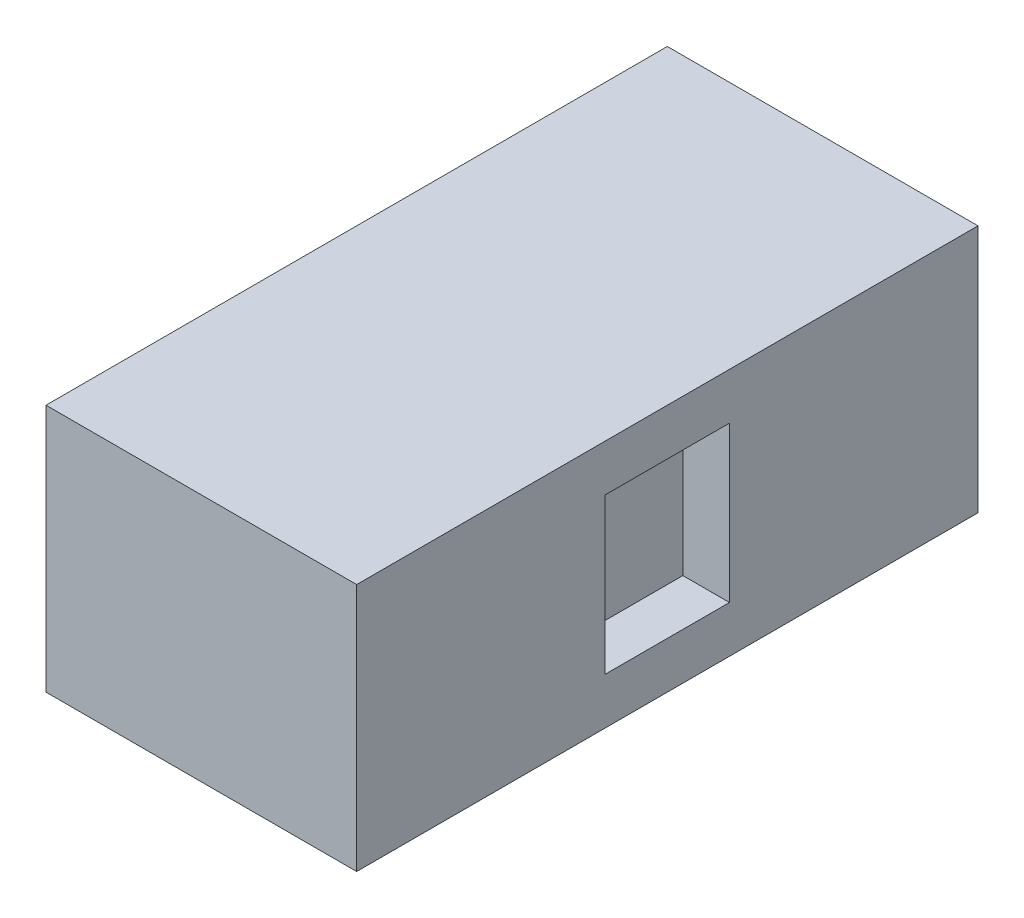
ISO-10303-21;
HEADER;
FILE_DESCRIPTION(('STEP AP214'),'2;1');
FILE_NAME('part.step','',(''),(''),'','','');
FILE_SCHEMA(('AUTOMOTIVE_DESIGN { 1 0 10303 214 1 1 1 1 }'));
ENDSEC;
DATA;
#1=APPLICATION_CONTEXT('core data for automotive mechanical design processes');
#2=APPLICATION_PROTOCOL_DEFINITION('international standard','automotive_design',2000,#1);
#3=PRODUCT_CONTEXT('',#1,'mechanical');
#4=PRODUCT('Part','Part','',(#3));
#5=PRODUCT_RELATED_PRODUCT_CATEGORY('part','',(#4));
#6=PRODUCT_DEFINITION_FORMATION('','',#4);
#7=PRODUCT_DEFINITION_CONTEXT('part definition',#1,'design');
#8=PRODUCT_DEFINITION('design','',#6,#7);
#9=PRODUCT_DEFINITION_SHAPE('','',#8);
#10=(LENGTH_UNIT() NAMED_UNIT(*) SI_UNIT(.MILLI.,.METRE.));
#11=(NAMED_UNIT(*) PLANE_ANGLE_UNIT() SI_UNIT($,.RADIAN.));
#12=(NAMED_UNIT(*) SI_UNIT($,.STERADIAN.) SOLID_ANGLE_UNIT());
#13=UNCERTAINTY_MEASURE_WITH_UNIT(LENGTH_MEASURE(1.E-05),#10,'distance_accuracy_value','');
#14=(GEOMETRIC_REPRESENTATION_CONTEXT(3) GLOBAL_UNCERTAINTY_ASSIGNED_CONTEXT((#13)) GLOBAL_UNIT_ASSIGNED_CONTEXT((#10,
#11,#12)) REPRESENTATION_CONTEXT('',''));
#15=CARTESIAN_POINT('',(0.,0.,0.));
#16=DIRECTION('',(0.,0.,1.));
#17=DIRECTION('',(1.,0.,0.));
#18=AXIS2_PLACEMENT_3D('',#15,#16,#17);
#19=CARTESIAN_POINT('',(0.,3.,0.));
#20=DIRECTION('',(0.,1.,0.));
#21=DIRECTION('',(0.,0.,1.));
#22=AXIS2_PLACEMENT_3D('',#19,#20,#21);
#23=PLANE('',#22);
#24=DIRECTION('',(0.,0.,-1.));
#25=VECTOR('',#24,1.);
#26=CARTESIAN_POINT('',(10.,3.,20.));
#27=LINE('',#26,#25);
#28=CARTESIAN_POINT('',(10.,3.,4.));
#29=VERTEX_POINT('',#28);
#30=CARTESIAN_POINT('',(10.,3.,-4.));
#31=VERTEX_POINT('',#30);
#32=EDGE_CURVE('E62',#29,#31,#27,.T.);
#33=ORIENTED_EDGE('',*,*,#32,.T.);
#34=DIRECTION('',(-1.,0.,0.));
#35=VECTOR('',#34,1.);
#36=CARTESIAN_POINT('',(0.,3.,-4.));
#37=LINE('',#36,#35);
#38=CARTESIAN_POINT('',(7.,3.,-4.));
#39=VERTEX_POINT('',#38);
#40=EDGE_CURVE('E57',#31,#39,#37,.T.);
#41=ORIENTED_EDGE('',*,*,#40,.T.);
#42=DIRECTION('',(0.,0.,-1.));
#43=VECTOR('',#42,1.);
#44=CARTESIAN_POINT('',(7.,3.,0.));
#45=LINE('',#44,#43);
#46=CARTESIAN_POINT('',(7.,3.,4.));
#47=VERTEX_POINT('',#46);
#48=EDGE_CURVE('E142',#47,#39,#45,.T.);
#49=ORIENTED_EDGE('',*,*,#48,.F.);
#50=DIRECTION('',(-1.,0.,0.));
#51=VECTOR('',#50,1.);
#52=CARTESIAN_POINT('',(0.,3.,4.));
#53=LINE('',#52,#51);
#54=EDGE_CURVE('E153',#29,#47,#53,.T.);
#55=ORIENTED_EDGE('',*,*,#54,.F.);
#56=EDGE_LOOP('',(#33,#41,#49,#55));
#57=FACE_BOUND('',#56,.T.);
#58=ADVANCED_FACE('F41',(#57),#23,.T.);
#59=CARTESIAN_POINT('',(-10.,3.,20.));
#60=DIRECTION('',(1.,0.,0.));
#61=DIRECTION('',(0.,0.,-1.));
#62=AXIS2_PLACEMENT_3D('',#59,#60,#61);
#63=PLANE('',#62);
#64=DIRECTION('',(0.,0.,1.));
#65=VECTOR('',#64,1.);
#66=CARTESIAN_POINT('',(-10.,0.,20.));
#67=LINE('',#66,#65);
#68=CARTESIAN_POINT('',(-10.,0.,-20.));
#69=VERTEX_POINT('',#68);
#70=CARTESIAN_POINT('',(-10.,0.,20.));
#71=VERTEX_POINT('',#70);
#72=EDGE_CURVE('E111',#69,#71,#67,.T.);
#73=ORIENTED_EDGE('',*,*,#72,.T.);
#74=DIRECTION('',(0.,-1.,0.));
#75=VECTOR('',#74,1.);
#76=CARTESIAN_POINT('',(-10.,3.,20.));
#77=LINE('',#76,#75);
#78=CARTESIAN_POINT('',(-10.,16.,20.));
#79=VERTEX_POINT('',#78);
#80=EDGE_CURVE('E11',#79,#71,#77,.T.);
#81=ORIENTED_EDGE('',*,*,#80,.F.);
#82=DIRECTION('',(0.,0.,1.));
#83=VECTOR('',#82,1.);
#84=CARTESIAN_POINT('',(-10.,16.,-20.));
#85=LINE('',#84,#83);
#86=CARTESIAN_POINT('',(-10.,16.,-20.));
#87=VERTEX_POINT('',#86);
#88=EDGE_CURVE('E109',#87,#79,#85,.T.);
#89=ORIENTED_EDGE('',*,*,#88,.F.);
#90=DIRECTION('',(0.,-1.,0.));
#91=VECTOR('',#90,1.);
#92=CARTESIAN_POINT('',(-10.,3.,-20.));
#93=LINE('',#92,#91);
#94=EDGE_CURVE('E175',#87,#69,#93,.T.);
#95=ORIENTED_EDGE('',*,*,#94,.T.);
#96=EDGE_LOOP('',(#73,#81,#89,#95));
#97=FACE_BOUND('',#96,.T.);
#98=ADVANCED_FACE('F43',(#97),#63,.F.);
#99=CARTESIAN_POINT('',(10.,3.,20.));
#100=DIRECTION('',(0.,0.,-1.));
#101=DIRECTION('',(-1.,0.,0.));
#102=AXIS2_PLACEMENT_3D('',#99,#100,#101);
#103=PLANE('',#102);
#104=DIRECTION('',(1.,0.,0.));
#105=VECTOR('',#104,1.);
#106=CARTESIAN_POINT('',(10.,0.,20.));
#107=LINE('',#106,#105);
#108=CARTESIAN_POINT('',(10.,0.,20.));
#109=VERTEX_POINT('',#108);
#110=EDGE_CURVE('E179',#71,#109,#107,.T.);
#111=ORIENTED_EDGE('',*,*,#110,.T.);
#112=DIRECTION('',(0.,-1.,0.));
#113=VECTOR('',#112,1.);
#114=CARTESIAN_POINT('',(10.,3.,20.));
#115=LINE('',#114,#113);
#116=CARTESIAN_POINT('',(10.,16.,20.));
#117=VERTEX_POINT('',#116);
#118=EDGE_CURVE('E50',#117,#109,#115,.T.);
#119=ORIENTED_EDGE('',*,*,#118,.F.);
#120=DIRECTION('',(1.,0.,0.));
#121=VECTOR('',#120,1.);
#122=CARTESIAN_POINT('',(-10.,16.,20.));
#123=LINE('',#122,#121);
#124=EDGE_CURVE('E114',#79,#117,#123,.T.);
#125=ORIENTED_EDGE('',*,*,#124,.F.);
#126=ORIENTED_EDGE('',*,*,#80,.T.);
#127=EDGE_LOOP('',(#111,#119,#125,#126));
#128=FACE_BOUND('',#127,.T.);
#129=ADVANCED_FACE('F115',(#128),#103,.F.);
#130=CARTESIAN_POINT('',(10.,3.,20.));
#131=DIRECTION('',(-1.,0.,0.));
#132=DIRECTION('',(0.,0.,1.));
#133=AXIS2_PLACEMENT_3D('',#130,#131,#132);
#134=PLANE('',#133);
#135=DIRECTION('',(0.,-1.,0.));
#136=VECTOR('',#135,1.);
#137=CARTESIAN_POINT('',(10.,3.,-20.));
#138=LINE('',#137,#136);
#139=CARTESIAN_POINT('',(10.,16.,-20.));
#140=VERTEX_POINT('',#139);
#141=CARTESIAN_POINT('',(10.,0.,-20.));
#142=VERTEX_POINT('',#141);
#143=EDGE_CURVE('E189',#140,#142,#138,.T.);
#144=ORIENTED_EDGE('',*,*,#143,.F.);
#145=DIRECTION('',(0.,0.,-1.));
#146=VECTOR('',#145,1.);
#147=CARTESIAN_POINT('',(10.,16.,-20.));
#148=LINE('',#147,#146);
#149=EDGE_CURVE('E121',#117,#140,#148,.T.);
#150=ORIENTED_EDGE('',*,*,#149,.F.);
#151=ORIENTED_EDGE('',*,*,#118,.T.);
#152=DIRECTION('',(0.,0.,-1.));
#153=VECTOR('',#152,1.);
#154=CARTESIAN_POINT('',(10.,0.,20.));
#155=LINE('',#154,#153);
#156=EDGE_CURVE('E182',#109,#142,#155,.T.);
#157=ORIENTED_EDGE('',*,*,#156,.T.);
#158=EDGE_LOOP('',(#144,#150,#151,#157));
#159=FACE_BOUND('',#158,.T.);
#160=DIRECTION('',(0.,0.,-1.));
#161=VECTOR('',#160,1.);
#162=CARTESIAN_POINT('',(10.,13.,-20.));
#163=LINE('',#162,#161);
#164=CARTESIAN_POINT('',(10.,13.,4.));
#165=VERTEX_POINT('',#164);
#166=CARTESIAN_POINT('',(10.,13.,-4.));
#167=VERTEX_POINT('',#166);
#168=EDGE_CURVE('E128',#165,#167,#163,.T.);
#169=ORIENTED_EDGE('',*,*,#168,.T.);
#170=DIRECTION('',(0.,-1.,0.));
#171=VECTOR('',#170,1.);
#172=CARTESIAN_POINT('',(10.,13.,-4.));
#173=LINE('',#172,#171);
#174=EDGE_CURVE('E170',#167,#31,#173,.T.);
#175=ORIENTED_EDGE('',*,*,#174,.T.);
#176=ORIENTED_EDGE('',*,*,#32,.F.);
#177=DIRECTION('',(0.,-1.,0.));
#178=VECTOR('',#177,1.);
#179=CARTESIAN_POINT('',(10.,13.,4.));
#180=LINE('',#179,#178);
#181=EDGE_CURVE('E166',#165,#29,#180,.T.);
#182=ORIENTED_EDGE('',*,*,#181,.F.);
#183=EDGE_LOOP('',(#169,#175,#176,#182));
#184=FACE_BOUND('',#183,.T.);
#185=ADVANCED_FACE('F195',(#159,#184),#134,.F.);
#186=CARTESIAN_POINT('',(10.,3.,-20.));
#187=DIRECTION('',(0.,0.,1.));
#188=DIRECTION('',(1.,0.,0.));
#189=AXIS2_PLACEMENT_3D('',#186,#187,#188);
#190=PLANE('',#189);
#191=DIRECTION('',(-1.,0.,0.));
#192=VECTOR('',#191,1.);
#193=CARTESIAN_POINT('',(10.,0.,-20.));
#194=LINE('',#193,#192);
#195=EDGE_CURVE('E176',#142,#69,#194,.T.);
#196=ORIENTED_EDGE('',*,*,#195,.T.);
#197=ORIENTED_EDGE('',*,*,#94,.F.);
#198=DIRECTION('',(-1.,0.,0.));
#199=VECTOR('',#198,1.);
#200=CARTESIAN_POINT('',(-10.,16.,-20.));
#201=LINE('',#200,#199);
#202=EDGE_CURVE('E126',#140,#87,#201,.T.);
#203=ORIENTED_EDGE('',*,*,#202,.F.);
#204=ORIENTED_EDGE('',*,*,#143,.T.);
#205=EDGE_LOOP('',(#196,#197,#203,#204));
#206=FACE_BOUND('',#205,.T.);
#207=ADVANCED_FACE('F201',(#206),#190,.F.);
#208=CARTESIAN_POINT('',(0.,0.,0.));
#209=DIRECTION('',(0.,1.,0.));
#210=DIRECTION('',(0.,0.,1.));
#211=AXIS2_PLACEMENT_3D('',#208,#209,#210);
#212=PLANE('',#211);
#213=ORIENTED_EDGE('',*,*,#72,.F.);
#214=ORIENTED_EDGE('',*,*,#195,.F.);
#215=ORIENTED_EDGE('',*,*,#156,.F.);
#216=ORIENTED_EDGE('',*,*,#110,.F.);
#217=EDGE_LOOP('',(#213,#214,#215,#216));
#218=FACE_BOUND('',#217,.T.);
#219=ADVANCED_FACE('F199',(#218),#212,.F.);
#220=CARTESIAN_POINT('',(0.,13.,-4.));
#221=DIRECTION('',(0.,0.,1.));
#222=DIRECTION('',(1.,0.,0.));
#223=AXIS2_PLACEMENT_3D('',#220,#221,#222);
#224=PLANE('',#223);
#225=ORIENTED_EDGE('',*,*,#40,.F.);
#226=ORIENTED_EDGE('',*,*,#174,.F.);
#227=DIRECTION('',(-1.,0.,0.));
#228=VECTOR('',#227,1.);
#229=CARTESIAN_POINT('',(0.,13.,-4.));
#230=LINE('',#229,#228);
#231=CARTESIAN_POINT('',(7.,13.,-4.));
#232=VERTEX_POINT('',#231);
#233=EDGE_CURVE('E138',#167,#232,#230,.T.);
#234=ORIENTED_EDGE('',*,*,#233,.T.);
#235=DIRECTION('',(0.,-1.,0.));
#236=VECTOR('',#235,1.);
#237=CARTESIAN_POINT('',(7.,13.,-4.));
#238=LINE('',#237,#236);
#239=EDGE_CURVE('E150',#232,#39,#238,.T.);
#240=ORIENTED_EDGE('',*,*,#239,.T.);
#241=EDGE_LOOP('',(#225,#226,#234,#240));
#242=FACE_BOUND('',#241,.T.);
#243=ADVANCED_FACE('F208',(#242),#224,.T.);
#244=CARTESIAN_POINT('',(0.,13.,4.));
#245=DIRECTION('',(0.,0.,1.));
#246=DIRECTION('',(1.,0.,0.));
#247=AXIS2_PLACEMENT_3D('',#244,#245,#246);
#248=PLANE('',#247);
#249=ORIENTED_EDGE('',*,*,#54,.T.);
#250=DIRECTION('',(0.,-1.,0.));
#251=VECTOR('',#250,1.);
#252=CARTESIAN_POINT('',(7.,13.,4.));
#253=LINE('',#252,#251);
#254=CARTESIAN_POINT('',(7.,13.,4.));
#255=VERTEX_POINT('',#254);
#256=EDGE_CURVE('E162',#255,#47,#253,.T.);
#257=ORIENTED_EDGE('',*,*,#256,.F.);
#258=DIRECTION('',(-1.,0.,0.));
#259=VECTOR('',#258,1.);
#260=CARTESIAN_POINT('',(0.,13.,4.));
#261=LINE('',#260,#259);
#262=EDGE_CURVE('E141',#165,#255,#261,.T.);
#263=ORIENTED_EDGE('',*,*,#262,.F.);
#264=ORIENTED_EDGE('',*,*,#181,.T.);
#265=EDGE_LOOP('',(#249,#257,#263,#264));
#266=FACE_BOUND('',#265,.T.);
#267=ADVANCED_FACE('F219',(#266),#248,.F.);
#268=CARTESIAN_POINT('',(7.,13.,0.));
#269=DIRECTION('',(-1.,0.,0.));
#270=DIRECTION('',(0.,0.,1.));
#271=AXIS2_PLACEMENT_3D('',#268,#269,#270);
#272=PLANE('',#271);
#273=ORIENTED_EDGE('',*,*,#48,.T.);
#274=ORIENTED_EDGE('',*,*,#239,.F.);
#275=DIRECTION('',(0.,0.,-1.));
#276=VECTOR('',#275,1.);
#277=CARTESIAN_POINT('',(7.,13.,0.));
#278=LINE('',#277,#276);
#279=EDGE_CURVE('E146',#255,#232,#278,.T.);
#280=ORIENTED_EDGE('',*,*,#279,.F.);
#281=ORIENTED_EDGE('',*,*,#256,.T.);
#282=EDGE_LOOP('',(#273,#274,#280,#281));
#283=FACE_BOUND('',#282,.T.);
#284=ADVANCED_FACE('F223',(#283),#272,.F.);
#285=CARTESIAN_POINT('',(0.,16.,0.));
#286=DIRECTION('',(0.,1.,0.));
#287=DIRECTION('',(0.,0.,1.));
#288=AXIS2_PLACEMENT_3D('',#285,#286,#287);
#289=PLANE('',#288);
#290=ORIENTED_EDGE('',*,*,#88,.T.);
#291=ORIENTED_EDGE('',*,*,#124,.T.);
#292=ORIENTED_EDGE('',*,*,#149,.T.);
#293=ORIENTED_EDGE('',*,*,#202,.T.);
#294=EDGE_LOOP('',(#290,#291,#292,#293));
#295=FACE_BOUND('',#294,.T.);
#296=ADVANCED_FACE('F124',(#295),#289,.T.);
#297=CARTESIAN_POINT('',(0.,13.,0.));
#298=DIRECTION('',(0.,1.,0.));
#299=DIRECTION('',(0.,0.,1.));
#300=AXIS2_PLACEMENT_3D('',#297,#298,#299);
#301=PLANE('',#300);
#302=ORIENTED_EDGE('',*,*,#233,.F.);
#303=ORIENTED_EDGE('',*,*,#168,.F.);
#304=ORIENTED_EDGE('',*,*,#262,.T.);
#305=ORIENTED_EDGE('',*,*,#279,.T.);
#306=EDGE_LOOP('',(#302,#303,#304,#305));
#307=FACE_BOUND('',#306,.T.);
#308=ADVANCED_FACE('F228',(#307),#301,.F.);
#309=CLOSED_SHELL('',(#58,#98,#129,#185,#207,#219,#243,#267,#284,#296,#308));
#310=MANIFOLD_SOLID_BREP('B2',#309);
#311=ADVANCED_BREP_SHAPE_REPRESENTATION('',(#18,#310),#14);
#312=SHAPE_DEFINITION_REPRESENTATION(#9,#311);
ENDSEC;
END-ISO-10303-21;
